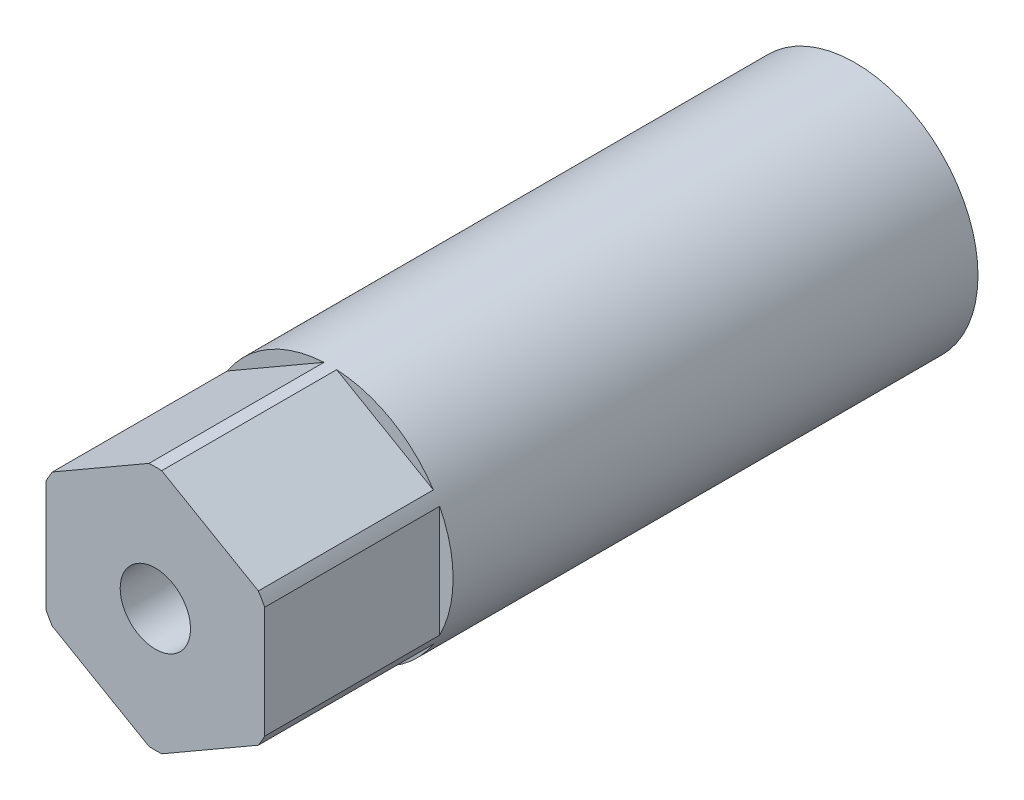
ISO-10303-21;
HEADER;
FILE_DESCRIPTION(('STEP AP214'),'2;1');
FILE_NAME('part.step','',(''),(''),'','','');
FILE_SCHEMA(('AUTOMOTIVE_DESIGN { 1 0 10303 214 1 1 1 1 }'));
ENDSEC;
DATA;
#1=APPLICATION_CONTEXT('core data for automotive mechanical design processes');
#2=APPLICATION_PROTOCOL_DEFINITION('international standard','automotive_design',2000,#1);
#3=PRODUCT_CONTEXT('',#1,'mechanical');
#4=PRODUCT('Part','Part','',(#3));
#5=PRODUCT_RELATED_PRODUCT_CATEGORY('part','',(#4));
#6=PRODUCT_DEFINITION_FORMATION('','',#4);
#7=PRODUCT_DEFINITION_CONTEXT('part definition',#1,'design');
#8=PRODUCT_DEFINITION('design','',#6,#7);
#9=PRODUCT_DEFINITION_SHAPE('','',#8);
#10=(LENGTH_UNIT() NAMED_UNIT(*) SI_UNIT(.MILLI.,.METRE.));
#11=(NAMED_UNIT(*) PLANE_ANGLE_UNIT() SI_UNIT($,.RADIAN.));
#12=(NAMED_UNIT(*) SI_UNIT($,.STERADIAN.) SOLID_ANGLE_UNIT());
#13=UNCERTAINTY_MEASURE_WITH_UNIT(LENGTH_MEASURE(1.E-05),#10,'distance_accuracy_value','');
#14=(GEOMETRIC_REPRESENTATION_CONTEXT(3) GLOBAL_UNCERTAINTY_ASSIGNED_CONTEXT((#13)) GLOBAL_UNIT_ASSIGNED_CONTEXT((#10,
#11,#12)) REPRESENTATION_CONTEXT('',''));
#15=CARTESIAN_POINT('',(0.,0.,0.));
#16=DIRECTION('',(0.,0.,1.));
#17=DIRECTION('',(1.,0.,0.));
#18=AXIS2_PLACEMENT_3D('',#15,#16,#17);
#19=CARTESIAN_POINT('',(0.,0.,50.8));
#20=DIRECTION('',(0.,0.,1.));
#21=DIRECTION('',(1.,0.,0.));
#22=AXIS2_PLACEMENT_3D('',#19,#20,#21);
#23=PLANE('',#22);
#24=CARTESIAN_POINT('',(0.,0.,50.8));
#25=DIRECTION('',(0.,0.,-1.));
#26=DIRECTION('',(-1.,0.,0.));
#27=AXIS2_PLACEMENT_3D('',#24,#25,#26);
#28=CIRCLE('',#27,2.5527);
#29=CARTESIAN_POINT('',(-2.5527,0.,50.8));
#30=VERTEX_POINT('',#29);
#31=EDGE_CURVE('E11',#30,#30,#28,.T.);
#32=ORIENTED_EDGE('',*,*,#31,.T.);
#33=EDGE_LOOP('',(#32));
#34=FACE_BOUND('',#33,.T.);
#35=CARTESIAN_POINT('',(0.,0.,50.8));
#36=DIRECTION('',(0.,0.,1.));
#37=DIRECTION('',(1.,0.,0.));
#38=AXIS2_PLACEMENT_3D('',#35,#36,#37);
#39=CIRCLE('',#38,8.91143552338531);
#40=CARTESIAN_POINT('',(-7.47693081462319,4.84862750485041,50.8));
#41=VERTEX_POINT('',#40);
#42=CARTESIAN_POINT('',(-7.9375,4.05089827537715,50.8));
#43=VERTEX_POINT('',#42);
#44=EDGE_CURVE('E23',#41,#43,#39,.T.);
#45=ORIENTED_EDGE('',*,*,#44,.T.);
#46=DIRECTION('',(0.,-1.,0.));
#47=VECTOR('',#46,1.);
#48=CARTESIAN_POINT('',(-7.9375,0.,50.8));
#49=LINE('',#48,#47);
#50=CARTESIAN_POINT('',(-7.9375,-4.05089827537715,50.8));
#51=VERTEX_POINT('',#50);
#52=EDGE_CURVE('E34',#43,#51,#49,.T.);
#53=ORIENTED_EDGE('',*,*,#52,.T.);
#54=CARTESIAN_POINT('',(-7.47693081462319,-4.84862750485041,50.8));
#55=VERTEX_POINT('',#54);
#56=EDGE_CURVE('E212',#51,#55,#39,.T.);
#57=ORIENTED_EDGE('',*,*,#56,.T.);
#58=DIRECTION('',(0.866025403784439,-0.5,0.));
#59=VECTOR('',#58,1.);
#60=CARTESIAN_POINT('',(-3.96875,-6.87407664253898,50.8));
#61=LINE('',#60,#59);
#62=CARTESIAN_POINT('',(-0.460569185376818,-8.89952578022756,50.8));
#63=VERTEX_POINT('',#62);
#64=EDGE_CURVE('E210',#55,#63,#61,.T.);
#65=ORIENTED_EDGE('',*,*,#64,.T.);
#66=CARTESIAN_POINT('',(0.460569185376817,-8.89952578022756,50.8));
#67=VERTEX_POINT('',#66);
#68=EDGE_CURVE('E209',#63,#67,#39,.T.);
#69=ORIENTED_EDGE('',*,*,#68,.T.);
#70=DIRECTION('',(0.866025403784439,0.5,0.));
#71=VECTOR('',#70,1.);
#72=CARTESIAN_POINT('',(3.96875,-6.87407664253898,50.8));
#73=LINE('',#72,#71);
#74=CARTESIAN_POINT('',(7.47693081462318,-4.84862750485041,50.8));
#75=VERTEX_POINT('',#74);
#76=EDGE_CURVE('E207',#67,#75,#73,.T.);
#77=ORIENTED_EDGE('',*,*,#76,.T.);
#78=CARTESIAN_POINT('',(7.9375,-4.05089827537715,50.8));
#79=VERTEX_POINT('',#78);
#80=EDGE_CURVE('E206',#75,#79,#39,.T.);
#81=ORIENTED_EDGE('',*,*,#80,.T.);
#82=DIRECTION('',(0.,1.,0.));
#83=VECTOR('',#82,1.);
#84=CARTESIAN_POINT('',(7.9375,0.,50.8));
#85=LINE('',#84,#83);
#86=CARTESIAN_POINT('',(7.9375,4.05089827537716,50.8));
#87=VERTEX_POINT('',#86);
#88=EDGE_CURVE('E204',#79,#87,#85,.T.);
#89=ORIENTED_EDGE('',*,*,#88,.T.);
#90=CARTESIAN_POINT('',(7.47693081462319,4.84862750485041,50.8));
#91=VERTEX_POINT('',#90);
#92=EDGE_CURVE('E203',#87,#91,#39,.T.);
#93=ORIENTED_EDGE('',*,*,#92,.T.);
#94=DIRECTION('',(-0.866025403784439,0.5,0.));
#95=VECTOR('',#94,1.);
#96=CARTESIAN_POINT('',(3.96875,6.87407664253898,50.8));
#97=LINE('',#96,#95);
#98=CARTESIAN_POINT('',(0.460569185376813,8.89952578022756,50.8));
#99=VERTEX_POINT('',#98);
#100=EDGE_CURVE('E201',#91,#99,#97,.T.);
#101=ORIENTED_EDGE('',*,*,#100,.T.);
#102=CARTESIAN_POINT('',(-0.460569185376815,8.89952578022756,50.8));
#103=VERTEX_POINT('',#102);
#104=EDGE_CURVE('E200',#99,#103,#39,.T.);
#105=ORIENTED_EDGE('',*,*,#104,.T.);
#106=DIRECTION('',(-0.866025403784439,-0.5,0.));
#107=VECTOR('',#106,1.);
#108=CARTESIAN_POINT('',(-3.96875,6.87407664253898,50.8));
#109=LINE('',#108,#107);
#110=EDGE_CURVE('E198',#103,#41,#109,.T.);
#111=ORIENTED_EDGE('',*,*,#110,.T.);
#112=EDGE_LOOP('',(#45,#53,#57,#65,#69,#77,#81,#89,#93,#101,#105,#111));
#113=FACE_BOUND('',#112,.T.);
#114=ADVANCED_FACE('F16',(#34,#113),#23,.T.);
#115=CARTESIAN_POINT('',(0.,0.,50.8));
#116=DIRECTION('',(0.,0.,-1.));
#117=DIRECTION('',(-1.,0.,0.));
#118=AXIS2_PLACEMENT_3D('',#115,#116,#117);
#119=CYLINDRICAL_SURFACE('',#118,8.91143552338531);
#120=CARTESIAN_POINT('',(0.,0.,38.1));
#121=DIRECTION('',(0.,0.,1.));
#122=DIRECTION('',(1.,0.,0.));
#123=AXIS2_PLACEMENT_3D('',#120,#121,#122);
#124=CIRCLE('',#123,8.91143552338531);
#125=CARTESIAN_POINT('',(-7.9375,4.05089827537715,38.1));
#126=VERTEX_POINT('',#125);
#127=CARTESIAN_POINT('',(-7.9375,-4.05089827537715,38.1));
#128=VERTEX_POINT('',#127);
#129=EDGE_CURVE('E195',#126,#128,#124,.T.);
#130=ORIENTED_EDGE('',*,*,#129,.F.);
#131=DIRECTION('',(0.,0.,1.));
#132=VECTOR('',#131,1.);
#133=CARTESIAN_POINT('',(-7.9375,4.05089827537715,38.1));
#134=LINE('',#133,#132);
#135=EDGE_CURVE('E193',#126,#43,#134,.T.);
#136=ORIENTED_EDGE('',*,*,#135,.T.);
#137=ORIENTED_EDGE('',*,*,#44,.F.);
#138=DIRECTION('',(0.,0.,1.));
#139=VECTOR('',#138,1.);
#140=CARTESIAN_POINT('',(-7.47693081462319,4.84862750485041,38.1));
#141=LINE('',#140,#139);
#142=CARTESIAN_POINT('',(-7.47693081462319,4.84862750485041,38.1));
#143=VERTEX_POINT('',#142);
#144=EDGE_CURVE('E190',#143,#41,#141,.T.);
#145=ORIENTED_EDGE('',*,*,#144,.F.);
#146=CARTESIAN_POINT('',(0.,0.,38.1));
#147=DIRECTION('',(0.,0.,1.));
#148=DIRECTION('',(1.,0.,0.));
#149=AXIS2_PLACEMENT_3D('',#146,#147,#148);
#150=CIRCLE('',#149,8.91143552338531);
#151=CARTESIAN_POINT('',(-0.460569185376815,8.89952578022756,38.1));
#152=VERTEX_POINT('',#151);
#153=EDGE_CURVE('E187',#152,#143,#150,.T.);
#154=ORIENTED_EDGE('',*,*,#153,.F.);
#155=DIRECTION('',(0.,0.,1.));
#156=VECTOR('',#155,1.);
#157=CARTESIAN_POINT('',(-0.460569185376815,8.89952578022756,38.1));
#158=LINE('',#157,#156);
#159=EDGE_CURVE('E184',#152,#103,#158,.T.);
#160=ORIENTED_EDGE('',*,*,#159,.T.);
#161=ORIENTED_EDGE('',*,*,#104,.F.);
#162=DIRECTION('',(0.,0.,1.));
#163=VECTOR('',#162,1.);
#164=CARTESIAN_POINT('',(0.460569185376813,8.89952578022756,38.1));
#165=LINE('',#164,#163);
#166=CARTESIAN_POINT('',(0.460569185376813,8.89952578022756,38.1));
#167=VERTEX_POINT('',#166);
#168=EDGE_CURVE('E181',#167,#99,#165,.T.);
#169=ORIENTED_EDGE('',*,*,#168,.F.);
#170=CARTESIAN_POINT('',(0.,0.,38.1));
#171=DIRECTION('',(0.,0.,1.));
#172=DIRECTION('',(1.,0.,0.));
#173=AXIS2_PLACEMENT_3D('',#170,#171,#172);
#174=CIRCLE('',#173,8.91143552338531);
#175=CARTESIAN_POINT('',(7.47693081462319,4.84862750485041,38.1));
#176=VERTEX_POINT('',#175);
#177=EDGE_CURVE('E178',#176,#167,#174,.T.);
#178=ORIENTED_EDGE('',*,*,#177,.F.);
#179=DIRECTION('',(0.,0.,1.));
#180=VECTOR('',#179,1.);
#181=CARTESIAN_POINT('',(7.47693081462319,4.84862750485041,38.1));
#182=LINE('',#181,#180);
#183=EDGE_CURVE('E175',#176,#91,#182,.T.);
#184=ORIENTED_EDGE('',*,*,#183,.T.);
#185=ORIENTED_EDGE('',*,*,#92,.F.);
#186=DIRECTION('',(0.,0.,1.));
#187=VECTOR('',#186,1.);
#188=CARTESIAN_POINT('',(7.9375,4.05089827537716,38.1));
#189=LINE('',#188,#187);
#190=CARTESIAN_POINT('',(7.9375,4.05089827537716,38.1));
#191=VERTEX_POINT('',#190);
#192=EDGE_CURVE('E172',#191,#87,#189,.T.);
#193=ORIENTED_EDGE('',*,*,#192,.F.);
#194=CARTESIAN_POINT('',(0.,0.,38.1));
#195=DIRECTION('',(0.,0.,1.));
#196=DIRECTION('',(1.,0.,0.));
#197=AXIS2_PLACEMENT_3D('',#194,#195,#196);
#198=CIRCLE('',#197,8.91143552338531);
#199=CARTESIAN_POINT('',(7.9375,-4.05089827537715,38.1));
#200=VERTEX_POINT('',#199);
#201=EDGE_CURVE('E169',#200,#191,#198,.T.);
#202=ORIENTED_EDGE('',*,*,#201,.F.);
#203=DIRECTION('',(0.,0.,1.));
#204=VECTOR('',#203,1.);
#205=CARTESIAN_POINT('',(7.9375,-4.05089827537715,38.1));
#206=LINE('',#205,#204);
#207=EDGE_CURVE('E166',#200,#79,#206,.T.);
#208=ORIENTED_EDGE('',*,*,#207,.T.);
#209=ORIENTED_EDGE('',*,*,#80,.F.);
#210=DIRECTION('',(0.,0.,1.));
#211=VECTOR('',#210,1.);
#212=CARTESIAN_POINT('',(7.47693081462318,-4.84862750485041,38.1));
#213=LINE('',#212,#211);
#214=CARTESIAN_POINT('',(7.47693081462318,-4.84862750485041,38.1));
#215=VERTEX_POINT('',#214);
#216=EDGE_CURVE('E163',#215,#75,#213,.T.);
#217=ORIENTED_EDGE('',*,*,#216,.F.);
#218=CARTESIAN_POINT('',(0.,0.,38.1));
#219=DIRECTION('',(0.,0.,1.));
#220=DIRECTION('',(1.,0.,0.));
#221=AXIS2_PLACEMENT_3D('',#218,#219,#220);
#222=CIRCLE('',#221,8.91143552338531);
#223=CARTESIAN_POINT('',(0.460569185376817,-8.89952578022756,38.1));
#224=VERTEX_POINT('',#223);
#225=EDGE_CURVE('E160',#224,#215,#222,.T.);
#226=ORIENTED_EDGE('',*,*,#225,.F.);
#227=DIRECTION('',(0.,0.,1.));
#228=VECTOR('',#227,1.);
#229=CARTESIAN_POINT('',(0.460569185376817,-8.89952578022756,38.1));
#230=LINE('',#229,#228);
#231=EDGE_CURVE('E157',#224,#67,#230,.T.);
#232=ORIENTED_EDGE('',*,*,#231,.T.);
#233=ORIENTED_EDGE('',*,*,#68,.F.);
#234=DIRECTION('',(0.,0.,1.));
#235=VECTOR('',#234,1.);
#236=CARTESIAN_POINT('',(-0.460569185376818,-8.89952578022756,38.1));
#237=LINE('',#236,#235);
#238=CARTESIAN_POINT('',(-0.460569185376818,-8.89952578022756,38.1));
#239=VERTEX_POINT('',#238);
#240=EDGE_CURVE('E154',#239,#63,#237,.T.);
#241=ORIENTED_EDGE('',*,*,#240,.F.);
#242=CARTESIAN_POINT('',(0.,0.,38.1));
#243=DIRECTION('',(0.,0.,1.));
#244=DIRECTION('',(1.,0.,0.));
#245=AXIS2_PLACEMENT_3D('',#242,#243,#244);
#246=CIRCLE('',#245,8.91143552338531);
#247=CARTESIAN_POINT('',(-7.47693081462319,-4.84862750485041,38.1));
#248=VERTEX_POINT('',#247);
#249=EDGE_CURVE('E151',#248,#239,#246,.T.);
#250=ORIENTED_EDGE('',*,*,#249,.F.);
#251=DIRECTION('',(0.,0.,1.));
#252=VECTOR('',#251,1.);
#253=CARTESIAN_POINT('',(-7.47693081462319,-4.84862750485041,38.1));
#254=LINE('',#253,#252);
#255=EDGE_CURVE('E148',#248,#55,#254,.T.);
#256=ORIENTED_EDGE('',*,*,#255,.T.);
#257=ORIENTED_EDGE('',*,*,#56,.F.);
#258=DIRECTION('',(0.,0.,1.));
#259=VECTOR('',#258,1.);
#260=CARTESIAN_POINT('',(-7.9375,-4.05089827537715,38.1));
#261=LINE('',#260,#259);
#262=EDGE_CURVE('E145',#128,#51,#261,.T.);
#263=ORIENTED_EDGE('',*,*,#262,.F.);
#264=EDGE_LOOP('',(#130,#136,#137,#145,#154,#160,#161,#169,#178,#184,#185,#193,#202,#208,#209,
#217,#226,#232,#233,#241,#250,#256,#257,#263));
#265=FACE_BOUND('',#264,.T.);
#266=CARTESIAN_POINT('',(0.,0.,0.));
#267=DIRECTION('',(0.,0.,1.));
#268=DIRECTION('',(1.,0.,0.));
#269=AXIS2_PLACEMENT_3D('',#266,#267,#268);
#270=CIRCLE('',#269,8.91143552338531);
#271=CARTESIAN_POINT('',(8.91143552338531,0.,0.));
#272=VERTEX_POINT('',#271);
#273=EDGE_CURVE('E142',#272,#272,#270,.T.);
#274=ORIENTED_EDGE('',*,*,#273,.T.);
#275=EDGE_LOOP('',(#274));
#276=FACE_BOUND('',#275,.T.);
#277=ADVANCED_FACE('F220',(#265,#276),#119,.T.);
#278=CARTESIAN_POINT('',(0.,0.,0.));
#279=DIRECTION('',(0.,0.,1.));
#280=DIRECTION('',(1.,0.,0.));
#281=AXIS2_PLACEMENT_3D('',#278,#279,#280);
#282=PLANE('',#281);
#283=CARTESIAN_POINT('',(0.,0.,0.));
#284=DIRECTION('',(0.,0.,1.));
#285=DIRECTION('',(1.,0.,0.));
#286=AXIS2_PLACEMENT_3D('',#283,#284,#285);
#287=CIRCLE('',#286,5.35813);
#288=CARTESIAN_POINT('',(5.35813,0.,0.));
#289=VERTEX_POINT('',#288);
#290=EDGE_CURVE('E139',#289,#289,#287,.T.);
#291=ORIENTED_EDGE('',*,*,#290,.T.);
#292=EDGE_LOOP('',(#291));
#293=FACE_BOUND('',#292,.T.);
#294=ORIENTED_EDGE('',*,*,#273,.F.);
#295=EDGE_LOOP('',(#294));
#296=FACE_BOUND('',#295,.T.);
#297=ADVANCED_FACE('F269',(#293,#296),#282,.F.);
#298=CARTESIAN_POINT('',(-3.96875,-6.87407664253898,38.1));
#299=DIRECTION('',(-0.5,-0.866025403784439,0.));
#300=DIRECTION('',(0.866025403784439,-0.5,0.));
#301=AXIS2_PLACEMENT_3D('',#298,#299,#300);
#302=PLANE('',#301);
#303=ORIENTED_EDGE('',*,*,#64,.F.);
#304=ORIENTED_EDGE('',*,*,#255,.F.);
#305=DIRECTION('',(0.866025403784439,-0.5,0.));
#306=VECTOR('',#305,1.);
#307=CARTESIAN_POINT('',(-3.96875,-6.87407664253898,38.1));
#308=LINE('',#307,#306);
#309=EDGE_CURVE('E136',#248,#239,#308,.T.);
#310=ORIENTED_EDGE('',*,*,#309,.T.);
#311=ORIENTED_EDGE('',*,*,#240,.T.);
#312=EDGE_LOOP('',(#303,#304,#310,#311));
#313=FACE_BOUND('',#312,.T.);
#314=ADVANCED_FACE('F224',(#313),#302,.T.);
#315=CARTESIAN_POINT('',(0.,0.,38.1));
#316=DIRECTION('',(0.,0.,1.));
#317=DIRECTION('',(1.,0.,0.));
#318=AXIS2_PLACEMENT_3D('',#315,#316,#317);
#319=PLANE('',#318);
#320=ORIENTED_EDGE('',*,*,#309,.F.);
#321=ORIENTED_EDGE('',*,*,#249,.T.);
#322=EDGE_LOOP('',(#320,#321));
#323=FACE_BOUND('',#322,.T.);
#324=ADVANCED_FACE('F292',(#323),#319,.T.);
#325=CARTESIAN_POINT('',(3.96875,-6.87407664253898,38.1));
#326=DIRECTION('',(0.5,-0.866025403784439,0.));
#327=DIRECTION('',(0.866025403784439,0.5,0.));
#328=AXIS2_PLACEMENT_3D('',#325,#326,#327);
#329=PLANE('',#328);
#330=ORIENTED_EDGE('',*,*,#76,.F.);
#331=ORIENTED_EDGE('',*,*,#231,.F.);
#332=DIRECTION('',(0.866025403784439,0.5,0.));
#333=VECTOR('',#332,1.);
#334=CARTESIAN_POINT('',(3.96875,-6.87407664253898,38.1));
#335=LINE('',#334,#333);
#336=EDGE_CURVE('E133',#224,#215,#335,.T.);
#337=ORIENTED_EDGE('',*,*,#336,.T.);
#338=ORIENTED_EDGE('',*,*,#216,.T.);
#339=EDGE_LOOP('',(#330,#331,#337,#338));
#340=FACE_BOUND('',#339,.T.);
#341=ADVANCED_FACE('F229',(#340),#329,.T.);
#342=CARTESIAN_POINT('',(0.,0.,38.1));
#343=DIRECTION('',(0.,0.,1.));
#344=DIRECTION('',(1.,0.,0.));
#345=AXIS2_PLACEMENT_3D('',#342,#343,#344);
#346=PLANE('',#345);
#347=ORIENTED_EDGE('',*,*,#336,.F.);
#348=ORIENTED_EDGE('',*,*,#225,.T.);
#349=EDGE_LOOP('',(#347,#348));
#350=FACE_BOUND('',#349,.T.);
#351=ADVANCED_FACE('F300',(#350),#346,.T.);
#352=CARTESIAN_POINT('',(7.9375,0.,38.1));
#353=DIRECTION('',(1.,0.,0.));
#354=DIRECTION('',(0.,1.,0.));
#355=AXIS2_PLACEMENT_3D('',#352,#353,#354);
#356=PLANE('',#355);
#357=ORIENTED_EDGE('',*,*,#88,.F.);
#358=ORIENTED_EDGE('',*,*,#207,.F.);
#359=DIRECTION('',(0.,1.,0.));
#360=VECTOR('',#359,1.);
#361=CARTESIAN_POINT('',(7.9375,0.,38.1));
#362=LINE('',#361,#360);
#363=EDGE_CURVE('E130',#200,#191,#362,.T.);
#364=ORIENTED_EDGE('',*,*,#363,.T.);
#365=ORIENTED_EDGE('',*,*,#192,.T.);
#366=EDGE_LOOP('',(#357,#358,#364,#365));
#367=FACE_BOUND('',#366,.T.);
#368=ADVANCED_FACE('F234',(#367),#356,.T.);
#369=CARTESIAN_POINT('',(0.,0.,38.1));
#370=DIRECTION('',(0.,0.,1.));
#371=DIRECTION('',(1.,0.,0.));
#372=AXIS2_PLACEMENT_3D('',#369,#370,#371);
#373=PLANE('',#372);
#374=ORIENTED_EDGE('',*,*,#363,.F.);
#375=ORIENTED_EDGE('',*,*,#201,.T.);
#376=EDGE_LOOP('',(#374,#375));
#377=FACE_BOUND('',#376,.T.);
#378=ADVANCED_FACE('F306',(#377),#373,.T.);
#379=CARTESIAN_POINT('',(3.96875,6.87407664253898,38.1));
#380=DIRECTION('',(0.5,0.866025403784439,0.));
#381=DIRECTION('',(-0.866025403784439,0.5,0.));
#382=AXIS2_PLACEMENT_3D('',#379,#380,#381);
#383=PLANE('',#382);
#384=ORIENTED_EDGE('',*,*,#100,.F.);
#385=ORIENTED_EDGE('',*,*,#183,.F.);
#386=DIRECTION('',(-0.866025403784439,0.5,0.));
#387=VECTOR('',#386,1.);
#388=CARTESIAN_POINT('',(3.96875,6.87407664253898,38.1));
#389=LINE('',#388,#387);
#390=EDGE_CURVE('E127',#176,#167,#389,.T.);
#391=ORIENTED_EDGE('',*,*,#390,.T.);
#392=ORIENTED_EDGE('',*,*,#168,.T.);
#393=EDGE_LOOP('',(#384,#385,#391,#392));
#394=FACE_BOUND('',#393,.T.);
#395=ADVANCED_FACE('F239',(#394),#383,.T.);
#396=CARTESIAN_POINT('',(0.,0.,38.1));
#397=DIRECTION('',(0.,0.,1.));
#398=DIRECTION('',(1.,0.,0.));
#399=AXIS2_PLACEMENT_3D('',#396,#397,#398);
#400=PLANE('',#399);
#401=ORIENTED_EDGE('',*,*,#390,.F.);
#402=ORIENTED_EDGE('',*,*,#177,.T.);
#403=EDGE_LOOP('',(#401,#402));
#404=FACE_BOUND('',#403,.T.);
#405=ADVANCED_FACE('F312',(#404),#400,.T.);
#406=CARTESIAN_POINT('',(-3.96875,6.87407664253898,38.1));
#407=DIRECTION('',(-0.5,0.866025403784439,0.));
#408=DIRECTION('',(-0.866025403784439,-0.5,0.));
#409=AXIS2_PLACEMENT_3D('',#406,#407,#408);
#410=PLANE('',#409);
#411=ORIENTED_EDGE('',*,*,#110,.F.);
#412=ORIENTED_EDGE('',*,*,#159,.F.);
#413=DIRECTION('',(-0.866025403784439,-0.5,0.));
#414=VECTOR('',#413,1.);
#415=CARTESIAN_POINT('',(-3.96875,6.87407664253898,38.1));
#416=LINE('',#415,#414);
#417=EDGE_CURVE('E124',#152,#143,#416,.T.);
#418=ORIENTED_EDGE('',*,*,#417,.T.);
#419=ORIENTED_EDGE('',*,*,#144,.T.);
#420=EDGE_LOOP('',(#411,#412,#418,#419));
#421=FACE_BOUND('',#420,.T.);
#422=ADVANCED_FACE('F244',(#421),#410,.T.);
#423=CARTESIAN_POINT('',(0.,0.,38.1));
#424=DIRECTION('',(0.,0.,1.));
#425=DIRECTION('',(1.,0.,0.));
#426=AXIS2_PLACEMENT_3D('',#423,#424,#425);
#427=PLANE('',#426);
#428=ORIENTED_EDGE('',*,*,#417,.F.);
#429=ORIENTED_EDGE('',*,*,#153,.T.);
#430=EDGE_LOOP('',(#428,#429));
#431=FACE_BOUND('',#430,.T.);
#432=ADVANCED_FACE('F261',(#431),#427,.T.);
#433=CARTESIAN_POINT('',(-7.9375,0.,38.1));
#434=DIRECTION('',(-1.,0.,0.));
#435=DIRECTION('',(0.,0.,1.));
#436=AXIS2_PLACEMENT_3D('',#433,#434,#435);
#437=PLANE('',#436);
#438=ORIENTED_EDGE('',*,*,#52,.F.);
#439=ORIENTED_EDGE('',*,*,#135,.F.);
#440=DIRECTION('',(0.,-1.,0.));
#441=VECTOR('',#440,1.);
#442=CARTESIAN_POINT('',(-7.9375,0.,38.1));
#443=LINE('',#442,#441);
#444=EDGE_CURVE('E119',#126,#128,#443,.T.);
#445=ORIENTED_EDGE('',*,*,#444,.T.);
#446=ORIENTED_EDGE('',*,*,#262,.T.);
#447=EDGE_LOOP('',(#438,#439,#445,#446));
#448=FACE_BOUND('',#447,.T.);
#449=ADVANCED_FACE('F248',(#448),#437,.T.);
#450=CARTESIAN_POINT('',(0.,0.,38.1));
#451=DIRECTION('',(0.,0.,1.));
#452=DIRECTION('',(1.,0.,0.));
#453=AXIS2_PLACEMENT_3D('',#450,#451,#452);
#454=PLANE('',#453);
#455=ORIENTED_EDGE('',*,*,#444,.F.);
#456=ORIENTED_EDGE('',*,*,#129,.T.);
#457=EDGE_LOOP('',(#455,#456));
#458=FACE_BOUND('',#457,.T.);
#459=ADVANCED_FACE('F250',(#458),#454,.T.);
#460=CARTESIAN_POINT('',(0.,0.,19.05));
#461=DIRECTION('',(0.,0.,-1.));
#462=DIRECTION('',(-1.,0.,0.));
#463=AXIS2_PLACEMENT_3D('',#460,#461,#462);
#464=CONICAL_SURFACE('',#463,5.35813,1.02974425867665);
#465=CARTESIAN_POINT('',(0.,0.,22.2694893086301));
#466=VERTEX_POINT('',#465);
#467=VERTEX_LOOP('',#466);
#468=FACE_BOUND('',#467,.T.);
#469=CARTESIAN_POINT('',(0.,0.,19.05));
#470=DIRECTION('',(0.,0.,1.));
#471=DIRECTION('',(1.,0.,0.));
#472=AXIS2_PLACEMENT_3D('',#469,#470,#471);
#473=CIRCLE('',#472,5.35813);
#474=CARTESIAN_POINT('',(5.35813,0.,19.05));
#475=VERTEX_POINT('',#474);
#476=EDGE_CURVE('E116',#475,#475,#473,.T.);
#477=ORIENTED_EDGE('',*,*,#476,.F.);
#478=EDGE_LOOP('',(#477));
#479=FACE_BOUND('',#478,.T.);
#480=ADVANCED_FACE('F252',(#468,#479),#464,.F.);
#481=CARTESIAN_POINT('',(0.,0.,0.));
#482=DIRECTION('',(0.,0.,1.));
#483=DIRECTION('',(1.,0.,0.));
#484=AXIS2_PLACEMENT_3D('',#481,#482,#483);
#485=CYLINDRICAL_SURFACE('',#484,5.35813);
#486=ORIENTED_EDGE('',*,*,#476,.T.);
#487=EDGE_LOOP('',(#486));
#488=FACE_BOUND('',#487,.T.);
#489=ORIENTED_EDGE('',*,*,#290,.F.);
#490=EDGE_LOOP('',(#489));
#491=FACE_BOUND('',#490,.T.);
#492=ADVANCED_FACE('F110',(#488,#491),#485,.F.);
#493=CARTESIAN_POINT('',(0.,0.,31.75));
#494=DIRECTION('',(0.,0.,1.));
#495=DIRECTION('',(1.,0.,0.));
#496=AXIS2_PLACEMENT_3D('',#493,#494,#495);
#497=CONICAL_SURFACE('',#496,2.5527,1.02974425867665);
#498=CARTESIAN_POINT('',(0.,0.,30.2161830978083));
#499=VERTEX_POINT('',#498);
#500=VERTEX_LOOP('',#499);
#501=FACE_BOUND('',#500,.T.);
#502=CARTESIAN_POINT('',(0.,0.,31.75));
#503=DIRECTION('',(0.,0.,-1.));
#504=DIRECTION('',(-1.,0.,0.));
#505=AXIS2_PLACEMENT_3D('',#502,#503,#504);
#506=CIRCLE('',#505,2.5527);
#507=CARTESIAN_POINT('',(-2.5527,0.,31.75));
#508=VERTEX_POINT('',#507);
#509=EDGE_CURVE('E114',#508,#508,#506,.T.);
#510=ORIENTED_EDGE('',*,*,#509,.F.);
#511=EDGE_LOOP('',(#510));
#512=FACE_BOUND('',#511,.T.);
#513=ADVANCED_FACE('F106',(#501,#512),#497,.F.);
#514=CARTESIAN_POINT('',(0.,0.,50.8));
#515=DIRECTION('',(0.,0.,-1.));
#516=DIRECTION('',(-1.,0.,0.));
#517=AXIS2_PLACEMENT_3D('',#514,#515,#516);
#518=CYLINDRICAL_SURFACE('',#517,2.5527);
#519=ORIENTED_EDGE('',*,*,#509,.T.);
#520=EDGE_LOOP('',(#519));
#521=FACE_BOUND('',#520,.T.);
#522=ORIENTED_EDGE('',*,*,#31,.F.);
#523=EDGE_LOOP('',(#522));
#524=FACE_BOUND('',#523,.T.);
#525=ADVANCED_FACE('F109',(#521,#524),#518,.F.);
#526=CLOSED_SHELL('',(#114,#277,#297,#314,#324,#341,#351,#368,#378,#395,#405,#422,#432,#449,
#459,#480,#492,#513,#525));
#527=MANIFOLD_SOLID_BREP('B1',#526);
#528=ADVANCED_BREP_SHAPE_REPRESENTATION('',(#18,#527),#14);
#529=SHAPE_DEFINITION_REPRESENTATION(#9,#528);
ENDSEC;
END-ISO-10303-21;
